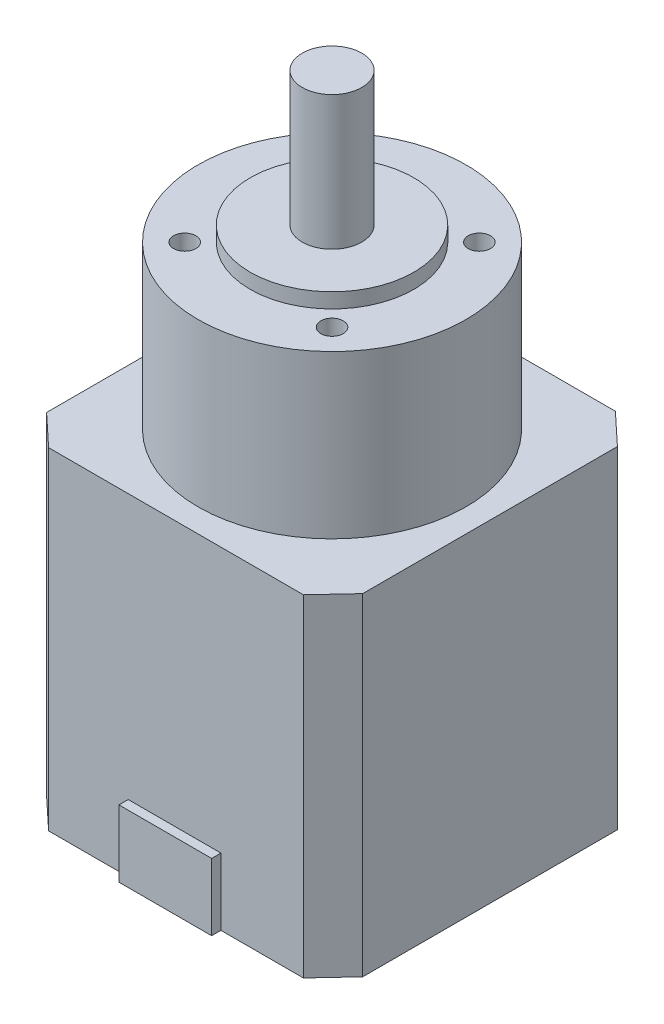
ISO-10303-21;
HEADER;
FILE_DESCRIPTION(('STEP AP214'),'2;1');
FILE_NAME('part.step','',(''),(''),'','','');
FILE_SCHEMA(('AUTOMOTIVE_DESIGN { 1 0 10303 214 1 1 1 1 }'));
ENDSEC;
DATA;
#1=APPLICATION_CONTEXT('core data for automotive mechanical design processes');
#2=APPLICATION_PROTOCOL_DEFINITION('international standard','automotive_design',2000,#1);
#3=PRODUCT_CONTEXT('',#1,'mechanical');
#4=PRODUCT('Part','Part','',(#3));
#5=PRODUCT_RELATED_PRODUCT_CATEGORY('part','',(#4));
#6=PRODUCT_DEFINITION_FORMATION('','',#4);
#7=PRODUCT_DEFINITION_CONTEXT('part definition',#1,'design');
#8=PRODUCT_DEFINITION('design','',#6,#7);
#9=PRODUCT_DEFINITION_SHAPE('','',#8);
#10=(LENGTH_UNIT() NAMED_UNIT(*) SI_UNIT(.MILLI.,.METRE.));
#11=(NAMED_UNIT(*) PLANE_ANGLE_UNIT() SI_UNIT($,.RADIAN.));
#12=(NAMED_UNIT(*) SI_UNIT($,.STERADIAN.) SOLID_ANGLE_UNIT());
#13=UNCERTAINTY_MEASURE_WITH_UNIT(LENGTH_MEASURE(1.E-05),#10,'distance_accuracy_value','');
#14=(GEOMETRIC_REPRESENTATION_CONTEXT(3) GLOBAL_UNCERTAINTY_ASSIGNED_CONTEXT((#13)) GLOBAL_UNIT_ASSIGNED_CONTEXT((#10,
#11,#12)) REPRESENTATION_CONTEXT('',''));
#15=CARTESIAN_POINT('',(0.,0.,0.));
#16=DIRECTION('',(0.,0.,1.));
#17=DIRECTION('',(1.,0.,0.));
#18=AXIS2_PLACEMENT_3D('',#15,#16,#17);
#19=CARTESIAN_POINT('',(0.,44.6,21.16));
#20=DIRECTION('',(0.,0.,-1.));
#21=DIRECTION('',(-1.,0.,0.));
#22=AXIS2_PLACEMENT_3D('',#19,#20,#21);
#23=PLANE('',#22);
#24=DIRECTION('',(0.,-1.,0.));
#25=VECTOR('',#24,1.);
#26=CARTESIAN_POINT('',(-6.22966481198596,9.,21.16));
#27=LINE('',#26,#25);
#28=CARTESIAN_POINT('',(-6.22966481198596,9.,21.16));
#29=VERTEX_POINT('',#28);
#30=CARTESIAN_POINT('',(-6.22966481198596,0.,21.16));
#31=VERTEX_POINT('',#30);
#32=EDGE_CURVE('E235',#29,#31,#27,.T.);
#33=ORIENTED_EDGE('',*,*,#32,.F.);
#34=DIRECTION('',(1.,0.,0.));
#35=VECTOR('',#34,1.);
#36=CARTESIAN_POINT('',(0.,9.,21.16));
#37=LINE('',#36,#35);
#38=CARTESIAN_POINT('',(6.22966481198597,9.,21.16));
#39=VERTEX_POINT('',#38);
#40=EDGE_CURVE('E620',#29,#39,#37,.T.);
#41=ORIENTED_EDGE('',*,*,#40,.T.);
#42=DIRECTION('',(0.,-1.,0.));
#43=VECTOR('',#42,1.);
#44=CARTESIAN_POINT('',(6.22966481198597,9.,21.16));
#45=LINE('',#44,#43);
#46=CARTESIAN_POINT('',(6.22966481198597,0.,21.16));
#47=VERTEX_POINT('',#46);
#48=EDGE_CURVE('E238',#39,#47,#45,.T.);
#49=ORIENTED_EDGE('',*,*,#48,.T.);
#50=DIRECTION('',(1.,0.,0.));
#51=VECTOR('',#50,1.);
#52=CARTESIAN_POINT('',(0.,0.,21.16));
#53=LINE('',#52,#51);
#54=CARTESIAN_POINT('',(17.3101929141105,0.,21.16));
#55=VERTEX_POINT('',#54);
#56=EDGE_CURVE('E151',#47,#55,#53,.T.);
#57=ORIENTED_EDGE('',*,*,#56,.T.);
#58=DIRECTION('',(0.,-1.,0.));
#59=VECTOR('',#58,1.);
#60=CARTESIAN_POINT('',(17.3101929141105,44.6,21.16));
#61=LINE('',#60,#59);
#62=CARTESIAN_POINT('',(17.3101929141105,44.6,21.16));
#63=VERTEX_POINT('',#62);
#64=EDGE_CURVE('E178',#63,#55,#61,.T.);
#65=ORIENTED_EDGE('',*,*,#64,.F.);
#66=DIRECTION('',(1.,0.,0.));
#67=VECTOR('',#66,1.);
#68=CARTESIAN_POINT('',(0.,44.6,21.16));
#69=LINE('',#68,#67);
#70=CARTESIAN_POINT('',(-16.9235688946392,44.6,21.16));
#71=VERTEX_POINT('',#70);
#72=EDGE_CURVE('E189',#71,#63,#69,.T.);
#73=ORIENTED_EDGE('',*,*,#72,.F.);
#74=DIRECTION('',(0.,-1.,0.));
#75=VECTOR('',#74,1.);
#76=CARTESIAN_POINT('',(-16.9235688946392,44.6,21.16));
#77=LINE('',#76,#75);
#78=CARTESIAN_POINT('',(-16.9235688946392,0.,21.16));
#79=VERTEX_POINT('',#78);
#80=EDGE_CURVE('E103',#71,#79,#77,.T.);
#81=ORIENTED_EDGE('',*,*,#80,.T.);
#82=EDGE_CURVE('E153',#79,#31,#53,.T.);
#83=ORIENTED_EDGE('',*,*,#82,.T.);
#84=EDGE_LOOP('',(#33,#41,#49,#57,#65,#73,#81,#83));
#85=FACE_BOUND('',#84,.T.);
#86=ADVANCED_FACE('F38',(#85),#23,.F.);
#87=CARTESIAN_POINT('',(-18.4448100517582,44.6,19.738460340801));
#88=DIRECTION('',(-0.682758241487453,0.,0.730644361971651));
#89=DIRECTION('',(0.730644361971651,0.,0.682758241487453));
#90=AXIS2_PLACEMENT_3D('',#87,#88,#89);
#91=PLANE('',#90);
#92=DIRECTION('',(-0.730644361971651,0.,-0.682758241487453));
#93=VECTOR('',#92,1.);
#94=CARTESIAN_POINT('',(-18.4448100517582,0.,19.738460340801));
#95=LINE('',#94,#93);
#96=CARTESIAN_POINT('',(-21.16,0.,17.2012227860439));
#97=VERTEX_POINT('',#96);
#98=EDGE_CURVE('E148',#79,#97,#95,.T.);
#99=ORIENTED_EDGE('',*,*,#98,.F.);
#100=ORIENTED_EDGE('',*,*,#80,.F.);
#101=DIRECTION('',(-0.730644361971651,0.,-0.682758241487453));
#102=VECTOR('',#101,1.);
#103=CARTESIAN_POINT('',(-18.4448100517582,44.6,19.738460340801));
#104=LINE('',#103,#102);
#105=CARTESIAN_POINT('',(-21.16,44.6,17.2012227860439));
#106=VERTEX_POINT('',#105);
#107=EDGE_CURVE('E170',#71,#106,#104,.T.);
#108=ORIENTED_EDGE('',*,*,#107,.T.);
#109=DIRECTION('',(0.,-1.,0.));
#110=VECTOR('',#109,1.);
#111=CARTESIAN_POINT('',(-21.16,44.6,17.2012227860439));
#112=LINE('',#111,#110);
#113=EDGE_CURVE('E98',#106,#97,#112,.T.);
#114=ORIENTED_EDGE('',*,*,#113,.T.);
#115=EDGE_LOOP('',(#99,#100,#108,#114));
#116=FACE_BOUND('',#115,.T.);
#117=ADVANCED_FACE('F40',(#116),#91,.T.);
#118=CARTESIAN_POINT('',(19.796633082954,44.6,18.4991701771517));
#119=DIRECTION('',(0.730644361971651,0.,0.682758241487453));
#120=DIRECTION('',(0.682758241487453,0.,-0.730644361971651));
#121=AXIS2_PLACEMENT_3D('',#118,#119,#120);
#122=PLANE('',#121);
#123=DIRECTION('',(-0.682758241487453,0.,0.730644361971651));
#124=VECTOR('',#123,1.);
#125=CARTESIAN_POINT('',(19.796633082954,0.,18.4991701771517));
#126=LINE('',#125,#124);
#127=CARTESIAN_POINT('',(21.16,0.,17.0401817816865));
#128=VERTEX_POINT('',#127);
#129=EDGE_CURVE('E156',#128,#55,#126,.T.);
#130=ORIENTED_EDGE('',*,*,#129,.F.);
#131=DIRECTION('',(0.,-1.,0.));
#132=VECTOR('',#131,1.);
#133=CARTESIAN_POINT('',(21.16,44.6,17.0401817816865));
#134=LINE('',#133,#132);
#135=CARTESIAN_POINT('',(21.16,44.6,17.0401817816865));
#136=VERTEX_POINT('',#135);
#137=EDGE_CURVE('E176',#136,#128,#134,.T.);
#138=ORIENTED_EDGE('',*,*,#137,.F.);
#139=DIRECTION('',(-0.682758241487453,0.,0.730644361971651));
#140=VECTOR('',#139,1.);
#141=CARTESIAN_POINT('',(19.796633082954,44.6,18.4991701771517));
#142=LINE('',#141,#140);
#143=EDGE_CURVE('E191',#136,#63,#142,.T.);
#144=ORIENTED_EDGE('',*,*,#143,.T.);
#145=ORIENTED_EDGE('',*,*,#64,.T.);
#146=EDGE_LOOP('',(#130,#138,#144,#145));
#147=FACE_BOUND('',#146,.T.);
#148=ADVANCED_FACE('F211',(#147),#122,.T.);
#149=CARTESIAN_POINT('',(21.16,44.6,0.));
#150=DIRECTION('',(1.,0.,0.));
#151=DIRECTION('',(0.,0.,-1.));
#152=AXIS2_PLACEMENT_3D('',#149,#150,#151);
#153=PLANE('',#152);
#154=DIRECTION('',(0.,0.,1.));
#155=VECTOR('',#154,1.);
#156=CARTESIAN_POINT('',(21.16,0.,0.));
#157=LINE('',#156,#155);
#158=CARTESIAN_POINT('',(21.16,0.,-17.1935800270621));
#159=VERTEX_POINT('',#158);
#160=EDGE_CURVE('E159',#159,#128,#157,.T.);
#161=ORIENTED_EDGE('',*,*,#160,.F.);
#162=DIRECTION('',(0.,-1.,0.));
#163=VECTOR('',#162,1.);
#164=CARTESIAN_POINT('',(21.16,44.6,-17.1935800270621));
#165=LINE('',#164,#163);
#166=CARTESIAN_POINT('',(21.16,44.6,-17.1935800270621));
#167=VERTEX_POINT('',#166);
#168=EDGE_CURVE('E174',#167,#159,#165,.T.);
#169=ORIENTED_EDGE('',*,*,#168,.F.);
#170=DIRECTION('',(0.,0.,1.));
#171=VECTOR('',#170,1.);
#172=CARTESIAN_POINT('',(21.16,44.6,0.));
#173=LINE('',#172,#171);
#174=EDGE_CURVE('E194',#167,#136,#173,.T.);
#175=ORIENTED_EDGE('',*,*,#174,.T.);
#176=ORIENTED_EDGE('',*,*,#137,.T.);
#177=EDGE_LOOP('',(#161,#169,#175,#176));
#178=FACE_BOUND('',#177,.T.);
#179=ADVANCED_FACE('F213',(#178),#153,.T.);
#180=CARTESIAN_POINT('',(18.4409974349982,44.6,-19.7343803212996));
#181=DIRECTION('',(0.682758241487453,0.,-0.730644361971651));
#182=DIRECTION('',(-0.730644361971651,0.,-0.682758241487453));
#183=AXIS2_PLACEMENT_3D('',#180,#181,#182);
#184=PLANE('',#183);
#185=DIRECTION('',(0.730644361971651,0.,0.682758241487453));
#186=VECTOR('',#185,1.);
#187=CARTESIAN_POINT('',(18.4409974349982,0.,-19.7343803212996));
#188=LINE('',#187,#186);
#189=CARTESIAN_POINT('',(16.9153901010039,0.,-21.16));
#190=VERTEX_POINT('',#189);
#191=EDGE_CURVE('E162',#190,#159,#188,.T.);
#192=ORIENTED_EDGE('',*,*,#191,.F.);
#193=DIRECTION('',(0.,-1.,0.));
#194=VECTOR('',#193,1.);
#195=CARTESIAN_POINT('',(16.9153901010039,44.6,-21.16));
#196=LINE('',#195,#194);
#197=CARTESIAN_POINT('',(16.9153901010039,44.6,-21.16));
#198=VERTEX_POINT('',#197);
#199=EDGE_CURVE('E133',#198,#190,#196,.T.);
#200=ORIENTED_EDGE('',*,*,#199,.F.);
#201=DIRECTION('',(0.730644361971651,0.,0.682758241487453));
#202=VECTOR('',#201,1.);
#203=CARTESIAN_POINT('',(18.4409974349982,44.6,-19.7343803212996));
#204=LINE('',#203,#202);
#205=EDGE_CURVE('E141',#198,#167,#204,.T.);
#206=ORIENTED_EDGE('',*,*,#205,.T.);
#207=ORIENTED_EDGE('',*,*,#168,.T.);
#208=EDGE_LOOP('',(#192,#200,#206,#207));
#209=FACE_BOUND('',#208,.T.);
#210=ADVANCED_FACE('F198',(#209),#184,.T.);
#211=CARTESIAN_POINT('',(0.,44.6,-21.16));
#212=DIRECTION('',(0.,0.,-1.));
#213=DIRECTION('',(-1.,0.,0.));
#214=AXIS2_PLACEMENT_3D('',#211,#212,#213);
#215=PLANE('',#214);
#216=DIRECTION('',(1.,0.,0.));
#217=VECTOR('',#216,1.);
#218=CARTESIAN_POINT('',(0.,0.,-21.16));
#219=LINE('',#218,#217);
#220=CARTESIAN_POINT('',(-17.0846098989955,0.,-21.16));
#221=VERTEX_POINT('',#220);
#222=EDGE_CURVE('E128',#221,#190,#219,.T.);
#223=ORIENTED_EDGE('',*,*,#222,.F.);
#224=DIRECTION('',(0.,-1.,0.));
#225=VECTOR('',#224,1.);
#226=CARTESIAN_POINT('',(-17.0846098989955,44.6,-21.16));
#227=LINE('',#226,#225);
#228=CARTESIAN_POINT('',(-17.0846098989955,44.6,-21.16));
#229=VERTEX_POINT('',#228);
#230=EDGE_CURVE('E123',#229,#221,#227,.T.);
#231=ORIENTED_EDGE('',*,*,#230,.F.);
#232=DIRECTION('',(1.,0.,0.));
#233=VECTOR('',#232,1.);
#234=CARTESIAN_POINT('',(0.,44.6,-21.16));
#235=LINE('',#234,#233);
#236=EDGE_CURVE('E126',#229,#198,#235,.T.);
#237=ORIENTED_EDGE('',*,*,#236,.T.);
#238=ORIENTED_EDGE('',*,*,#199,.T.);
#239=EDGE_LOOP('',(#223,#231,#237,#238));
#240=FACE_BOUND('',#239,.T.);
#241=ADVANCED_FACE('F125',(#240),#215,.T.);
#242=CARTESIAN_POINT('',(-19.6762075791466,44.6,-18.3866373096047));
#243=DIRECTION('',(-0.730644361971651,0.,-0.682758241487453));
#244=DIRECTION('',(-0.682758241487453,0.,0.730644361971651));
#245=AXIS2_PLACEMENT_3D('',#242,#243,#244);
#246=PLANE('',#245);
#247=DIRECTION('',(0.682758241487453,0.,-0.730644361971651));
#248=VECTOR('',#247,1.);
#249=CARTESIAN_POINT('',(-19.6762075791466,0.,-18.3866373096047));
#250=LINE('',#249,#248);
#251=CARTESIAN_POINT('',(-21.16,0.,-16.7987772139566));
#252=VERTEX_POINT('',#251);
#253=EDGE_CURVE('E166',#252,#221,#250,.T.);
#254=ORIENTED_EDGE('',*,*,#253,.F.);
#255=DIRECTION('',(0.,-1.,0.));
#256=VECTOR('',#255,1.);
#257=CARTESIAN_POINT('',(-21.16,44.6,-16.7987772139566));
#258=LINE('',#257,#256);
#259=CARTESIAN_POINT('',(-21.16,44.6,-16.7987772139566));
#260=VERTEX_POINT('',#259);
#261=EDGE_CURVE('E134',#260,#252,#258,.T.);
#262=ORIENTED_EDGE('',*,*,#261,.F.);
#263=DIRECTION('',(0.682758241487453,0.,-0.730644361971651));
#264=VECTOR('',#263,1.);
#265=CARTESIAN_POINT('',(-19.6762075791466,44.6,-18.3866373096047));
#266=LINE('',#265,#264);
#267=EDGE_CURVE('E138',#260,#229,#266,.T.);
#268=ORIENTED_EDGE('',*,*,#267,.T.);
#269=ORIENTED_EDGE('',*,*,#230,.T.);
#270=EDGE_LOOP('',(#254,#262,#268,#269));
#271=FACE_BOUND('',#270,.T.);
#272=ADVANCED_FACE('F143',(#271),#246,.T.);
#273=CARTESIAN_POINT('',(-21.16,44.6,0.));
#274=DIRECTION('',(1.,0.,0.));
#275=DIRECTION('',(0.,0.,-1.));
#276=AXIS2_PLACEMENT_3D('',#273,#274,#275);
#277=PLANE('',#276);
#278=DIRECTION('',(0.,0.,1.));
#279=VECTOR('',#278,1.);
#280=CARTESIAN_POINT('',(-21.16,0.,0.));
#281=LINE('',#280,#279);
#282=EDGE_CURVE('E168',#252,#97,#281,.T.);
#283=ORIENTED_EDGE('',*,*,#282,.T.);
#284=ORIENTED_EDGE('',*,*,#113,.F.);
#285=DIRECTION('',(0.,0.,1.));
#286=VECTOR('',#285,1.);
#287=CARTESIAN_POINT('',(-21.16,44.6,0.));
#288=LINE('',#287,#286);
#289=EDGE_CURVE('E64',#260,#106,#288,.T.);
#290=ORIENTED_EDGE('',*,*,#289,.F.);
#291=ORIENTED_EDGE('',*,*,#261,.T.);
#292=EDGE_LOOP('',(#283,#284,#290,#291));
#293=FACE_BOUND('',#292,.T.);
#294=ADVANCED_FACE('F204',(#293),#277,.F.);
#295=CARTESIAN_POINT('',(0.,44.6,0.));
#296=DIRECTION('',(0.,1.,0.));
#297=DIRECTION('',(0.,0.,1.));
#298=AXIS2_PLACEMENT_3D('',#295,#296,#297);
#299=PLANE('',#298);
#300=CARTESIAN_POINT('',(0.,44.6,0.));
#301=DIRECTION('',(0.,1.,0.));
#302=DIRECTION('',(0.,0.,1.));
#303=AXIS2_PLACEMENT_3D('',#300,#301,#302);
#304=CIRCLE('',#303,18.01);
#305=CARTESIAN_POINT('',(0.,44.6,18.01));
#306=VERTEX_POINT('',#305);
#307=EDGE_CURVE('E47',#306,#306,#304,.T.);
#308=ORIENTED_EDGE('',*,*,#307,.F.);
#309=EDGE_LOOP('',(#308));
#310=FACE_BOUND('',#309,.T.);
#311=ORIENTED_EDGE('',*,*,#107,.F.);
#312=ORIENTED_EDGE('',*,*,#72,.T.);
#313=ORIENTED_EDGE('',*,*,#143,.F.);
#314=ORIENTED_EDGE('',*,*,#174,.F.);
#315=ORIENTED_EDGE('',*,*,#205,.F.);
#316=ORIENTED_EDGE('',*,*,#236,.F.);
#317=ORIENTED_EDGE('',*,*,#267,.F.);
#318=ORIENTED_EDGE('',*,*,#289,.T.);
#319=EDGE_LOOP('',(#311,#312,#313,#314,#315,#316,#317,#318));
#320=FACE_BOUND('',#319,.T.);
#321=ADVANCED_FACE('F137',(#310,#320),#299,.T.);
#322=CARTESIAN_POINT('',(0.,0.,0.));
#323=DIRECTION('',(0.,1.,0.));
#324=DIRECTION('',(0.,0.,1.));
#325=AXIS2_PLACEMENT_3D('',#322,#323,#324);
#326=PLANE('',#325);
#327=ORIENTED_EDGE('',*,*,#98,.T.);
#328=ORIENTED_EDGE('',*,*,#282,.F.);
#329=ORIENTED_EDGE('',*,*,#253,.T.);
#330=ORIENTED_EDGE('',*,*,#222,.T.);
#331=ORIENTED_EDGE('',*,*,#191,.T.);
#332=ORIENTED_EDGE('',*,*,#160,.T.);
#333=ORIENTED_EDGE('',*,*,#129,.T.);
#334=ORIENTED_EDGE('',*,*,#56,.F.);
#335=DIRECTION('',(0.,0.,1.));
#336=VECTOR('',#335,1.);
#337=CARTESIAN_POINT('',(6.22966481198597,0.,0.));
#338=LINE('',#337,#336);
#339=CARTESIAN_POINT('',(6.22966481198597,0.,22.405276846925));
#340=VERTEX_POINT('',#339);
#341=EDGE_CURVE('E55',#47,#340,#338,.T.);
#342=ORIENTED_EDGE('',*,*,#341,.T.);
#343=DIRECTION('',(1.,0.,0.));
#344=VECTOR('',#343,1.);
#345=CARTESIAN_POINT('',(0.,0.,22.405276846925));
#346=LINE('',#345,#344);
#347=CARTESIAN_POINT('',(-6.22966481198596,0.,22.405276846925));
#348=VERTEX_POINT('',#347);
#349=EDGE_CURVE('E218',#348,#340,#346,.T.);
#350=ORIENTED_EDGE('',*,*,#349,.F.);
#351=DIRECTION('',(0.,0.,1.));
#352=VECTOR('',#351,1.);
#353=CARTESIAN_POINT('',(-6.22966481198596,0.,0.));
#354=LINE('',#353,#352);
#355=EDGE_CURVE('E220',#31,#348,#354,.T.);
#356=ORIENTED_EDGE('',*,*,#355,.F.);
#357=ORIENTED_EDGE('',*,*,#82,.F.);
#358=EDGE_LOOP('',(#327,#328,#329,#330,#331,#332,#333,#334,#342,#350,#356,#357));
#359=FACE_BOUND('',#358,.T.);
#360=ADVANCED_FACE('F201',(#359),#326,.F.);
#361=CARTESIAN_POINT('',(0.,66.4,0.));
#362=DIRECTION('',(0.,-1.,0.));
#363=DIRECTION('',(0.,0.,-1.));
#364=AXIS2_PLACEMENT_3D('',#361,#362,#363);
#365=CYLINDRICAL_SURFACE('',#364,18.01);
#366=CARTESIAN_POINT('',(0.,66.4,0.));
#367=DIRECTION('',(0.,1.,0.));
#368=DIRECTION('',(0.,0.,1.));
#369=AXIS2_PLACEMENT_3D('',#366,#367,#368);
#370=CIRCLE('',#369,18.01);
#371=CARTESIAN_POINT('',(0.,66.4,18.01));
#372=VERTEX_POINT('',#371);
#373=EDGE_CURVE('E152',#372,#372,#370,.T.);
#374=ORIENTED_EDGE('',*,*,#373,.F.);
#375=EDGE_LOOP('',(#374));
#376=FACE_BOUND('',#375,.T.);
#377=ORIENTED_EDGE('',*,*,#307,.T.);
#378=EDGE_LOOP('',(#377));
#379=FACE_BOUND('',#378,.T.);
#380=ADVANCED_FACE('F276',(#376,#379),#365,.T.);
#381=CARTESIAN_POINT('',(0.,66.4,0.));
#382=DIRECTION('',(0.,1.,0.));
#383=DIRECTION('',(0.,0.,1.));
#384=AXIS2_PLACEMENT_3D('',#381,#382,#383);
#385=PLANE('',#384);
#386=CARTESIAN_POINT('',(-9.89949493661112,66.4,9.89949493661221));
#387=DIRECTION('',(0.,1.,0.));
#388=DIRECTION('',(0.,0.,1.));
#389=AXIS2_PLACEMENT_3D('',#386,#387,#388);
#390=CIRCLE('',#389,1.50000000000041);
#391=CARTESIAN_POINT('',(-9.89949493661112,66.4,11.3994949366126));
#392=VERTEX_POINT('',#391);
#393=EDGE_CURVE('E259',#392,#392,#390,.T.);
#394=ORIENTED_EDGE('',*,*,#393,.F.);
#395=EDGE_LOOP('',(#394));
#396=FACE_BOUND('',#395,.T.);
#397=CARTESIAN_POINT('',(-9.89949493661167,66.4,-9.89949493661112));
#398=DIRECTION('',(0.,1.,0.));
#399=DIRECTION('',(0.,0.,1.));
#400=AXIS2_PLACEMENT_3D('',#397,#398,#399);
#401=CIRCLE('',#400,1.50000000000059);
#402=CARTESIAN_POINT('',(-9.89949493661167,66.4,-8.39949493661053));
#403=VERTEX_POINT('',#402);
#404=EDGE_CURVE('E253',#403,#403,#401,.T.);
#405=ORIENTED_EDGE('',*,*,#404,.F.);
#406=EDGE_LOOP('',(#405));
#407=FACE_BOUND('',#406,.T.);
#408=CARTESIAN_POINT('',(9.89949493661167,66.4,-9.89949493661167));
#409=DIRECTION('',(0.,1.,0.));
#410=DIRECTION('',(0.,0.,1.));
#411=AXIS2_PLACEMENT_3D('',#408,#409,#410);
#412=CIRCLE('',#411,1.5);
#413=CARTESIAN_POINT('',(9.89949493661167,66.4,-8.39949493661167));
#414=VERTEX_POINT('',#413);
#415=EDGE_CURVE('E247',#414,#414,#412,.T.);
#416=ORIENTED_EDGE('',*,*,#415,.F.);
#417=EDGE_LOOP('',(#416));
#418=FACE_BOUND('',#417,.T.);
#419=CARTESIAN_POINT('',(9.89949493661221,66.4,9.89949493661167));
#420=DIRECTION('',(0.,1.,0.));
#421=DIRECTION('',(0.,0.,1.));
#422=AXIS2_PLACEMENT_3D('',#419,#420,#421);
#423=CIRCLE('',#422,1.49999999999986);
#424=CARTESIAN_POINT('',(9.89949493661221,66.4,11.3994949366115));
#425=VERTEX_POINT('',#424);
#426=EDGE_CURVE('E246',#425,#425,#423,.T.);
#427=ORIENTED_EDGE('',*,*,#426,.F.);
#428=EDGE_LOOP('',(#427));
#429=FACE_BOUND('',#428,.T.);
#430=CARTESIAN_POINT('',(0.,66.4,0.));
#431=DIRECTION('',(0.,1.,0.));
#432=DIRECTION('',(0.,0.,1.));
#433=AXIS2_PLACEMENT_3D('',#430,#431,#432);
#434=CIRCLE('',#433,11.);
#435=CARTESIAN_POINT('',(0.,66.4,11.));
#436=VERTEX_POINT('',#435);
#437=EDGE_CURVE('E11',#436,#436,#434,.T.);
#438=ORIENTED_EDGE('',*,*,#437,.F.);
#439=EDGE_LOOP('',(#438));
#440=FACE_BOUND('',#439,.T.);
#441=ORIENTED_EDGE('',*,*,#373,.T.);
#442=EDGE_LOOP('',(#441));
#443=FACE_BOUND('',#442,.T.);
#444=ADVANCED_FACE('F274',(#396,#407,#418,#429,#440,#443),#385,.T.);
#445=CARTESIAN_POINT('',(0.,68.4,0.));
#446=DIRECTION('',(0.,-1.,0.));
#447=DIRECTION('',(0.,0.,-1.));
#448=AXIS2_PLACEMENT_3D('',#445,#446,#447);
#449=CYLINDRICAL_SURFACE('',#448,11.);
#450=CARTESIAN_POINT('',(0.,68.4,0.));
#451=DIRECTION('',(0.,1.,0.));
#452=DIRECTION('',(0.,0.,1.));
#453=AXIS2_PLACEMENT_3D('',#450,#451,#452);
#454=CIRCLE('',#453,11.);
#455=CARTESIAN_POINT('',(0.,68.4,11.));
#456=VERTEX_POINT('',#455);
#457=EDGE_CURVE('E265',#456,#456,#454,.T.);
#458=ORIENTED_EDGE('',*,*,#457,.F.);
#459=EDGE_LOOP('',(#458));
#460=FACE_BOUND('',#459,.T.);
#461=ORIENTED_EDGE('',*,*,#437,.T.);
#462=EDGE_LOOP('',(#461));
#463=FACE_BOUND('',#462,.T.);
#464=ADVANCED_FACE('F283',(#460,#463),#449,.T.);
#465=CARTESIAN_POINT('',(0.,68.4,0.));
#466=DIRECTION('',(0.,1.,0.));
#467=DIRECTION('',(0.,0.,1.));
#468=AXIS2_PLACEMENT_3D('',#465,#466,#467);
#469=PLANE('',#468);
#470=CARTESIAN_POINT('',(0.,68.4,0.));
#471=DIRECTION('',(0.,1.,0.));
#472=DIRECTION('',(0.,0.,1.));
#473=AXIS2_PLACEMENT_3D('',#470,#471,#472);
#474=CIRCLE('',#473,4.);
#475=CARTESIAN_POINT('',(0.,68.4,4.));
#476=VERTEX_POINT('',#475);
#477=EDGE_CURVE('E42',#476,#476,#474,.F.);
#478=ORIENTED_EDGE('',*,*,#477,.T.);
#479=EDGE_LOOP('',(#478));
#480=FACE_BOUND('',#479,.T.);
#481=ORIENTED_EDGE('',*,*,#457,.T.);
#482=EDGE_LOOP('',(#481));
#483=FACE_BOUND('',#482,.T.);
#484=ADVANCED_FACE('F468',(#480,#483),#469,.T.);
#485=CARTESIAN_POINT('',(9.89949493661221,61.9,9.89949493661167));
#486=DIRECTION('',(0.,1.,0.));
#487=DIRECTION('',(0.,0.,1.));
#488=AXIS2_PLACEMENT_3D('',#485,#486,#487);
#489=CYLINDRICAL_SURFACE('',#488,1.49999999999986);
#490=CARTESIAN_POINT('',(9.89949493661221,61.9,9.89949493661167));
#491=DIRECTION('',(0.,1.,0.));
#492=DIRECTION('',(0.,0.,1.));
#493=AXIS2_PLACEMENT_3D('',#490,#491,#492);
#494=CIRCLE('',#493,1.49999999999986);
#495=CARTESIAN_POINT('',(9.89949493661221,61.9,11.3994949366115));
#496=VERTEX_POINT('',#495);
#497=EDGE_CURVE('E262',#496,#496,#494,.T.);
#498=ORIENTED_EDGE('',*,*,#497,.F.);
#499=EDGE_LOOP('',(#498));
#500=FACE_BOUND('',#499,.T.);
#501=ORIENTED_EDGE('',*,*,#426,.T.);
#502=EDGE_LOOP('',(#501));
#503=FACE_BOUND('',#502,.T.);
#504=ADVANCED_FACE('F458',(#500,#503),#489,.F.);
#505=CARTESIAN_POINT('',(9.89949493661221,61.9,9.89949493661167));
#506=DIRECTION('',(0.,1.,0.));
#507=DIRECTION('',(0.,0.,1.));
#508=AXIS2_PLACEMENT_3D('',#505,#506,#507);
#509=PLANE('',#508);
#510=ORIENTED_EDGE('',*,*,#497,.T.);
#511=EDGE_LOOP('',(#510));
#512=FACE_BOUND('',#511,.T.);
#513=ADVANCED_FACE('F448',(#512),#509,.T.);
#514=CARTESIAN_POINT('',(9.89949493661167,61.9,-9.89949493661167));
#515=DIRECTION('',(0.,1.,0.));
#516=DIRECTION('',(0.,0.,1.));
#517=AXIS2_PLACEMENT_3D('',#514,#515,#516);
#518=CYLINDRICAL_SURFACE('',#517,1.5);
#519=CARTESIAN_POINT('',(9.89949493661167,61.9,-9.89949493661167));
#520=DIRECTION('',(0.,1.,0.));
#521=DIRECTION('',(0.,0.,1.));
#522=AXIS2_PLACEMENT_3D('',#519,#520,#521);
#523=CIRCLE('',#522,1.5);
#524=CARTESIAN_POINT('',(9.89949493661167,61.9,-8.39949493661167));
#525=VERTEX_POINT('',#524);
#526=EDGE_CURVE('E243',#525,#525,#523,.T.);
#527=ORIENTED_EDGE('',*,*,#526,.F.);
#528=EDGE_LOOP('',(#527));
#529=FACE_BOUND('',#528,.T.);
#530=ORIENTED_EDGE('',*,*,#415,.T.);
#531=EDGE_LOOP('',(#530));
#532=FACE_BOUND('',#531,.T.);
#533=ADVANCED_FACE('F438',(#529,#532),#518,.F.);
#534=CARTESIAN_POINT('',(9.89949493661167,61.9,-9.89949493661167));
#535=DIRECTION('',(0.,1.,0.));
#536=DIRECTION('',(0.,0.,1.));
#537=AXIS2_PLACEMENT_3D('',#534,#535,#536);
#538=PLANE('',#537);
#539=ORIENTED_EDGE('',*,*,#526,.T.);
#540=EDGE_LOOP('',(#539));
#541=FACE_BOUND('',#540,.T.);
#542=ADVANCED_FACE('F428',(#541),#538,.T.);
#543=CARTESIAN_POINT('',(-9.89949493661167,61.9,-9.89949493661112));
#544=DIRECTION('',(0.,1.,0.));
#545=DIRECTION('',(0.,0.,1.));
#546=AXIS2_PLACEMENT_3D('',#543,#544,#545);
#547=CYLINDRICAL_SURFACE('',#546,1.50000000000059);
#548=CARTESIAN_POINT('',(-9.89949493661167,61.9,-9.89949493661112));
#549=DIRECTION('',(0.,1.,0.));
#550=DIRECTION('',(0.,0.,1.));
#551=AXIS2_PLACEMENT_3D('',#548,#549,#550);
#552=CIRCLE('',#551,1.50000000000059);
#553=CARTESIAN_POINT('',(-9.89949493661167,61.9,-8.39949493661053));
#554=VERTEX_POINT('',#553);
#555=EDGE_CURVE('E250',#554,#554,#552,.T.);
#556=ORIENTED_EDGE('',*,*,#555,.F.);
#557=EDGE_LOOP('',(#556));
#558=FACE_BOUND('',#557,.T.);
#559=ORIENTED_EDGE('',*,*,#404,.T.);
#560=EDGE_LOOP('',(#559));
#561=FACE_BOUND('',#560,.T.);
#562=ADVANCED_FACE('F418',(#558,#561),#547,.F.);
#563=CARTESIAN_POINT('',(-9.89949493661167,61.9,-9.89949493661112));
#564=DIRECTION('',(0.,1.,0.));
#565=DIRECTION('',(0.,0.,1.));
#566=AXIS2_PLACEMENT_3D('',#563,#564,#565);
#567=PLANE('',#566);
#568=ORIENTED_EDGE('',*,*,#555,.T.);
#569=EDGE_LOOP('',(#568));
#570=FACE_BOUND('',#569,.T.);
#571=ADVANCED_FACE('F408',(#570),#567,.T.);
#572=CARTESIAN_POINT('',(-9.89949493661112,61.9,9.89949493661221));
#573=DIRECTION('',(0.,1.,0.));
#574=DIRECTION('',(0.,0.,1.));
#575=AXIS2_PLACEMENT_3D('',#572,#573,#574);
#576=CYLINDRICAL_SURFACE('',#575,1.50000000000041);
#577=CARTESIAN_POINT('',(-9.89949493661112,61.9,9.89949493661221));
#578=DIRECTION('',(0.,1.,0.));
#579=DIRECTION('',(0.,0.,1.));
#580=AXIS2_PLACEMENT_3D('',#577,#578,#579);
#581=CIRCLE('',#580,1.50000000000041);
#582=CARTESIAN_POINT('',(-9.89949493661112,61.9,11.3994949366126));
#583=VERTEX_POINT('',#582);
#584=EDGE_CURVE('E256',#583,#583,#581,.T.);
#585=ORIENTED_EDGE('',*,*,#584,.F.);
#586=EDGE_LOOP('',(#585));
#587=FACE_BOUND('',#586,.T.);
#588=ORIENTED_EDGE('',*,*,#393,.T.);
#589=EDGE_LOOP('',(#588));
#590=FACE_BOUND('',#589,.T.);
#591=ADVANCED_FACE('F398',(#587,#590),#576,.F.);
#592=CARTESIAN_POINT('',(-9.89949493661112,61.9,9.89949493661221));
#593=DIRECTION('',(0.,1.,0.));
#594=DIRECTION('',(0.,0.,1.));
#595=AXIS2_PLACEMENT_3D('',#592,#593,#594);
#596=PLANE('',#595);
#597=ORIENTED_EDGE('',*,*,#584,.T.);
#598=EDGE_LOOP('',(#597));
#599=FACE_BOUND('',#598,.T.);
#600=ADVANCED_FACE('F388',(#599),#596,.T.);
#601=CARTESIAN_POINT('',(0.,86.4,0.));
#602=DIRECTION('',(0.,-1.,0.));
#603=DIRECTION('',(0.,0.,-1.));
#604=AXIS2_PLACEMENT_3D('',#601,#602,#603);
#605=CYLINDRICAL_SURFACE('',#604,4.);
#606=ORIENTED_EDGE('',*,*,#477,.F.);
#607=EDGE_LOOP('',(#606));
#608=FACE_BOUND('',#607,.T.);
#609=CARTESIAN_POINT('',(0.,86.4,0.));
#610=DIRECTION('',(0.,1.,0.));
#611=DIRECTION('',(0.,0.,1.));
#612=AXIS2_PLACEMENT_3D('',#609,#610,#611);
#613=CIRCLE('',#612,4.);
#614=CARTESIAN_POINT('',(0.,86.4,4.));
#615=VERTEX_POINT('',#614);
#616=EDGE_CURVE('E240',#615,#615,#613,.T.);
#617=ORIENTED_EDGE('',*,*,#616,.F.);
#618=EDGE_LOOP('',(#617));
#619=FACE_BOUND('',#618,.T.);
#620=ADVANCED_FACE('F379',(#608,#619),#605,.T.);
#621=CARTESIAN_POINT('',(0.,86.4,0.));
#622=DIRECTION('',(0.,1.,0.));
#623=DIRECTION('',(0.,0.,1.));
#624=AXIS2_PLACEMENT_3D('',#621,#622,#623);
#625=PLANE('',#624);
#626=ORIENTED_EDGE('',*,*,#616,.T.);
#627=EDGE_LOOP('',(#626));
#628=FACE_BOUND('',#627,.T.);
#629=ADVANCED_FACE('F330',(#628),#625,.T.);
#630=CARTESIAN_POINT('',(6.22966481198597,9.,0.));
#631=DIRECTION('',(1.,0.,0.));
#632=DIRECTION('',(0.,0.,-1.));
#633=AXIS2_PLACEMENT_3D('',#630,#631,#632);
#634=PLANE('',#633);
#635=ORIENTED_EDGE('',*,*,#341,.F.);
#636=ORIENTED_EDGE('',*,*,#48,.F.);
#637=DIRECTION('',(0.,0.,1.));
#638=VECTOR('',#637,1.);
#639=CARTESIAN_POINT('',(6.22966481198597,9.,0.));
#640=LINE('',#639,#638);
#641=CARTESIAN_POINT('',(6.22966481198597,9.,22.405276846925));
#642=VERTEX_POINT('',#641);
#643=EDGE_CURVE('E229',#39,#642,#640,.T.);
#644=ORIENTED_EDGE('',*,*,#643,.T.);
#645=DIRECTION('',(0.,-1.,0.));
#646=VECTOR('',#645,1.);
#647=CARTESIAN_POINT('',(6.22966481198597,9.,22.405276846925));
#648=LINE('',#647,#646);
#649=EDGE_CURVE('E230',#642,#340,#648,.T.);
#650=ORIENTED_EDGE('',*,*,#649,.T.);
#651=EDGE_LOOP('',(#635,#636,#644,#650));
#652=FACE_BOUND('',#651,.T.);
#653=ADVANCED_FACE('F325',(#652),#634,.T.);
#654=CARTESIAN_POINT('',(-6.22966481198596,9.,0.));
#655=DIRECTION('',(1.,0.,0.));
#656=DIRECTION('',(0.,0.,-1.));
#657=AXIS2_PLACEMENT_3D('',#654,#655,#656);
#658=PLANE('',#657);
#659=ORIENTED_EDGE('',*,*,#355,.T.);
#660=DIRECTION('',(0.,-1.,0.));
#661=VECTOR('',#660,1.);
#662=CARTESIAN_POINT('',(-6.22966481198596,9.,22.405276846925));
#663=LINE('',#662,#661);
#664=CARTESIAN_POINT('',(-6.22966481198596,9.,22.405276846925));
#665=VERTEX_POINT('',#664);
#666=EDGE_CURVE('E232',#665,#348,#663,.T.);
#667=ORIENTED_EDGE('',*,*,#666,.F.);
#668=DIRECTION('',(0.,0.,1.));
#669=VECTOR('',#668,1.);
#670=CARTESIAN_POINT('',(-6.22966481198596,9.,0.));
#671=LINE('',#670,#669);
#672=EDGE_CURVE('E625',#29,#665,#671,.T.);
#673=ORIENTED_EDGE('',*,*,#672,.F.);
#674=ORIENTED_EDGE('',*,*,#32,.T.);
#675=EDGE_LOOP('',(#659,#667,#673,#674));
#676=FACE_BOUND('',#675,.T.);
#677=ADVANCED_FACE('F329',(#676),#658,.F.);
#678=CARTESIAN_POINT('',(0.,9.,22.405276846925));
#679=DIRECTION('',(0.,0.,-1.));
#680=DIRECTION('',(-1.,0.,0.));
#681=AXIS2_PLACEMENT_3D('',#678,#679,#680);
#682=PLANE('',#681);
#683=ORIENTED_EDGE('',*,*,#349,.T.);
#684=ORIENTED_EDGE('',*,*,#649,.F.);
#685=DIRECTION('',(1.,0.,0.));
#686=VECTOR('',#685,1.);
#687=CARTESIAN_POINT('',(0.,9.,22.405276846925));
#688=LINE('',#687,#686);
#689=EDGE_CURVE('E225',#665,#642,#688,.T.);
#690=ORIENTED_EDGE('',*,*,#689,.F.);
#691=ORIENTED_EDGE('',*,*,#666,.T.);
#692=EDGE_LOOP('',(#683,#684,#690,#691));
#693=FACE_BOUND('',#692,.T.);
#694=ADVANCED_FACE('F341',(#693),#682,.F.);
#695=CARTESIAN_POINT('',(0.,9.,0.));
#696=DIRECTION('',(0.,1.,0.));
#697=DIRECTION('',(0.,0.,1.));
#698=AXIS2_PLACEMENT_3D('',#695,#696,#697);
#699=PLANE('',#698);
#700=ORIENTED_EDGE('',*,*,#643,.F.);
#701=ORIENTED_EDGE('',*,*,#40,.F.);
#702=ORIENTED_EDGE('',*,*,#672,.T.);
#703=ORIENTED_EDGE('',*,*,#689,.T.);
#704=EDGE_LOOP('',(#700,#701,#702,#703));
#705=FACE_BOUND('',#704,.T.);
#706=ADVANCED_FACE('F352',(#705),#699,.T.);
#707=CLOSED_SHELL('',(#86,#117,#148,#179,#210,#241,#272,#294,#321,#360,#380,#444,#464,#484,#504,
#513,#533,#542,#562,#571,#591,#600,#620,#629,#653,#677,#694,#706));
#708=MANIFOLD_SOLID_BREP('B2',#707);
#709=ADVANCED_BREP_SHAPE_REPRESENTATION('',(#18,#708),#14);
#710=SHAPE_DEFINITION_REPRESENTATION(#9,#709);
ENDSEC;
END-ISO-10303-21;
